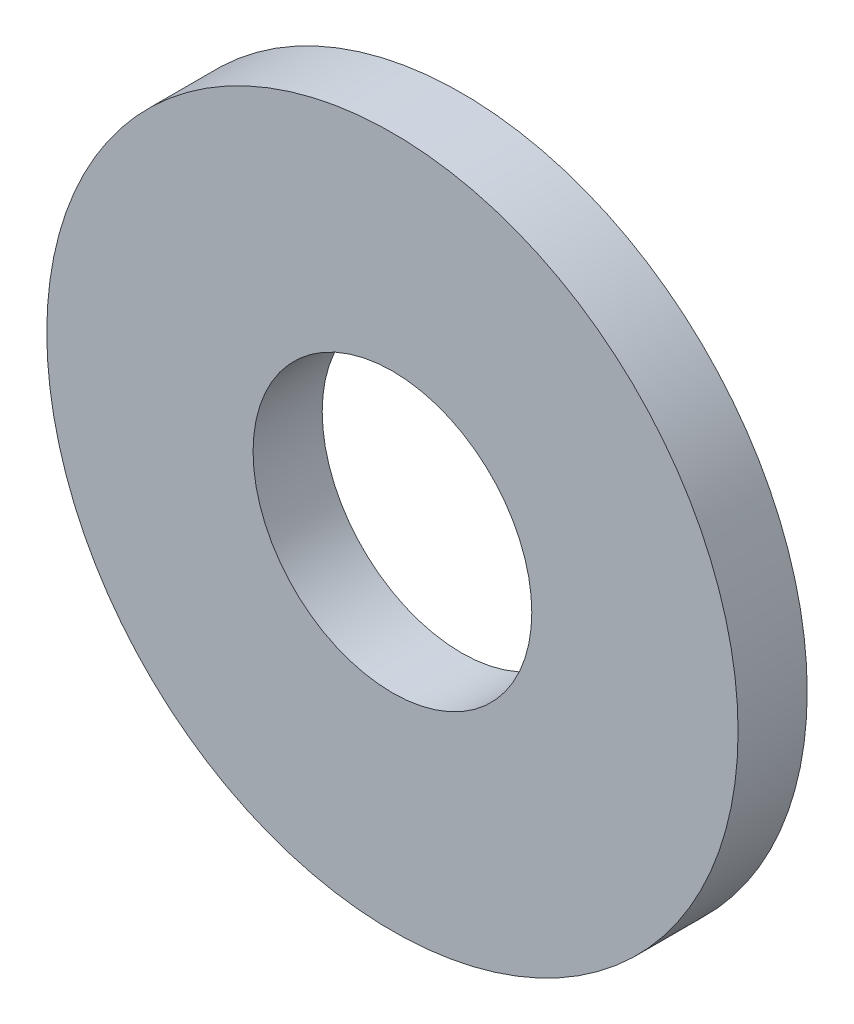
ISO-10303-21;
HEADER;
FILE_DESCRIPTION(('STEP AP214'),'2;1');
FILE_NAME('part.step','',(''),(''),'','','');
FILE_SCHEMA(('AUTOMOTIVE_DESIGN { 1 0 10303 214 1 1 1 1 }'));
ENDSEC;
DATA;
#1=APPLICATION_CONTEXT('core data for automotive mechanical design processes');
#2=APPLICATION_PROTOCOL_DEFINITION('international standard','automotive_design',2000,#1);
#3=PRODUCT_CONTEXT('',#1,'mechanical');
#4=PRODUCT('Part','Part','',(#3));
#5=PRODUCT_RELATED_PRODUCT_CATEGORY('part','',(#4));
#6=PRODUCT_DEFINITION_FORMATION('','',#4);
#7=PRODUCT_DEFINITION_CONTEXT('part definition',#1,'design');
#8=PRODUCT_DEFINITION('design','',#6,#7);
#9=PRODUCT_DEFINITION_SHAPE('','',#8);
#10=(LENGTH_UNIT() NAMED_UNIT(*) SI_UNIT(.MILLI.,.METRE.));
#11=(NAMED_UNIT(*) PLANE_ANGLE_UNIT() SI_UNIT($,.RADIAN.));
#12=(NAMED_UNIT(*) SI_UNIT($,.STERADIAN.) SOLID_ANGLE_UNIT());
#13=UNCERTAINTY_MEASURE_WITH_UNIT(LENGTH_MEASURE(1.E-05),#10,'distance_accuracy_value','');
#14=(GEOMETRIC_REPRESENTATION_CONTEXT(3) GLOBAL_UNCERTAINTY_ASSIGNED_CONTEXT((#13)) GLOBAL_UNIT_ASSIGNED_CONTEXT((#10,
#11,#12)) REPRESENTATION_CONTEXT('',''));
#15=CARTESIAN_POINT('',(0.,0.,0.));
#16=DIRECTION('',(0.,0.,1.));
#17=DIRECTION('',(1.,0.,0.));
#18=AXIS2_PLACEMENT_3D('',#15,#16,#17);
#19=CARTESIAN_POINT('',(0.,0.,0.79375));
#20=DIRECTION('',(0.,0.,1.));
#21=DIRECTION('',(1.,0.,0.));
#22=AXIS2_PLACEMENT_3D('',#19,#20,#21);
#23=PLANE('',#22);
#24=CARTESIAN_POINT('',(0.,0.,0.79375));
#25=DIRECTION('',(0.,0.,1.));
#26=DIRECTION('',(1.,0.,0.));
#27=AXIS2_PLACEMENT_3D('',#24,#25,#26);
#28=CIRCLE('',#27,7.9375);
#29=CARTESIAN_POINT('',(7.9375,0.,0.79375));
#30=VERTEX_POINT('',#29);
#31=EDGE_CURVE('E10',#30,#30,#28,.T.);
#32=ORIENTED_EDGE('',*,*,#31,.T.);
#33=EDGE_LOOP('',(#32));
#34=FACE_BOUND('',#33,.T.);
#35=CARTESIAN_POINT('',(0.,0.,0.79375));
#36=DIRECTION('',(0.,0.,1.));
#37=DIRECTION('',(1.,0.,0.));
#38=AXIS2_PLACEMENT_3D('',#35,#36,#37);
#39=CIRCLE('',#38,3.2004);
#40=CARTESIAN_POINT('',(3.2004,0.,0.79375));
#41=VERTEX_POINT('',#40);
#42=EDGE_CURVE('E43',#41,#41,#39,.T.);
#43=ORIENTED_EDGE('',*,*,#42,.F.);
#44=EDGE_LOOP('',(#43));
#45=FACE_BOUND('',#44,.T.);
#46=ADVANCED_FACE('F32',(#34,#45),#23,.T.);
#47=CARTESIAN_POINT('',(0.,0.,-0.79375));
#48=DIRECTION('',(0.,0.,1.));
#49=DIRECTION('',(1.,0.,0.));
#50=AXIS2_PLACEMENT_3D('',#47,#48,#49);
#51=PLANE('',#50);
#52=CARTESIAN_POINT('',(0.,0.,-0.79375));
#53=DIRECTION('',(0.,0.,1.));
#54=DIRECTION('',(1.,0.,0.));
#55=AXIS2_PLACEMENT_3D('',#52,#53,#54);
#56=CIRCLE('',#55,7.9375);
#57=CARTESIAN_POINT('',(7.9375,0.,-0.79375));
#58=VERTEX_POINT('',#57);
#59=EDGE_CURVE('E36',#58,#58,#56,.T.);
#60=ORIENTED_EDGE('',*,*,#59,.F.);
#61=EDGE_LOOP('',(#60));
#62=FACE_BOUND('',#61,.T.);
#63=CARTESIAN_POINT('',(0.,0.,-0.79375));
#64=DIRECTION('',(0.,0.,1.));
#65=DIRECTION('',(1.,0.,0.));
#66=AXIS2_PLACEMENT_3D('',#63,#64,#65);
#67=CIRCLE('',#66,3.2004);
#68=CARTESIAN_POINT('',(3.2004,0.,-0.79375));
#69=VERTEX_POINT('',#68);
#70=EDGE_CURVE('E45',#69,#69,#67,.T.);
#71=ORIENTED_EDGE('',*,*,#70,.T.);
#72=EDGE_LOOP('',(#71));
#73=FACE_BOUND('',#72,.T.);
#74=ADVANCED_FACE('F55',(#62,#73),#51,.F.);
#75=CARTESIAN_POINT('',(0.,0.,0.79375));
#76=DIRECTION('',(0.,0.,-1.));
#77=DIRECTION('',(-1.,0.,0.));
#78=AXIS2_PLACEMENT_3D('',#75,#76,#77);
#79=CYLINDRICAL_SURFACE('',#78,7.9375);
#80=ORIENTED_EDGE('',*,*,#31,.F.);
#81=EDGE_LOOP('',(#80));
#82=FACE_BOUND('',#81,.T.);
#83=ORIENTED_EDGE('',*,*,#59,.T.);
#84=EDGE_LOOP('',(#83));
#85=FACE_BOUND('',#84,.T.);
#86=ADVANCED_FACE('F34',(#82,#85),#79,.T.);
#87=CARTESIAN_POINT('',(0.,0.,0.79375));
#88=DIRECTION('',(0.,0.,-1.));
#89=DIRECTION('',(-1.,0.,0.));
#90=AXIS2_PLACEMENT_3D('',#87,#88,#89);
#91=CYLINDRICAL_SURFACE('',#90,3.2004);
#92=ORIENTED_EDGE('',*,*,#42,.T.);
#93=EDGE_LOOP('',(#92));
#94=FACE_BOUND('',#93,.T.);
#95=ORIENTED_EDGE('',*,*,#70,.F.);
#96=EDGE_LOOP('',(#95));
#97=FACE_BOUND('',#96,.T.);
#98=ADVANCED_FACE('F51',(#94,#97),#91,.F.);
#99=CLOSED_SHELL('',(#46,#74,#86,#98));
#100=MANIFOLD_SOLID_BREP('B2',#99);
#101=ADVANCED_BREP_SHAPE_REPRESENTATION('',(#18,#100),#14);
#102=SHAPE_DEFINITION_REPRESENTATION(#9,#101);
ENDSEC;
END-ISO-10303-21;
